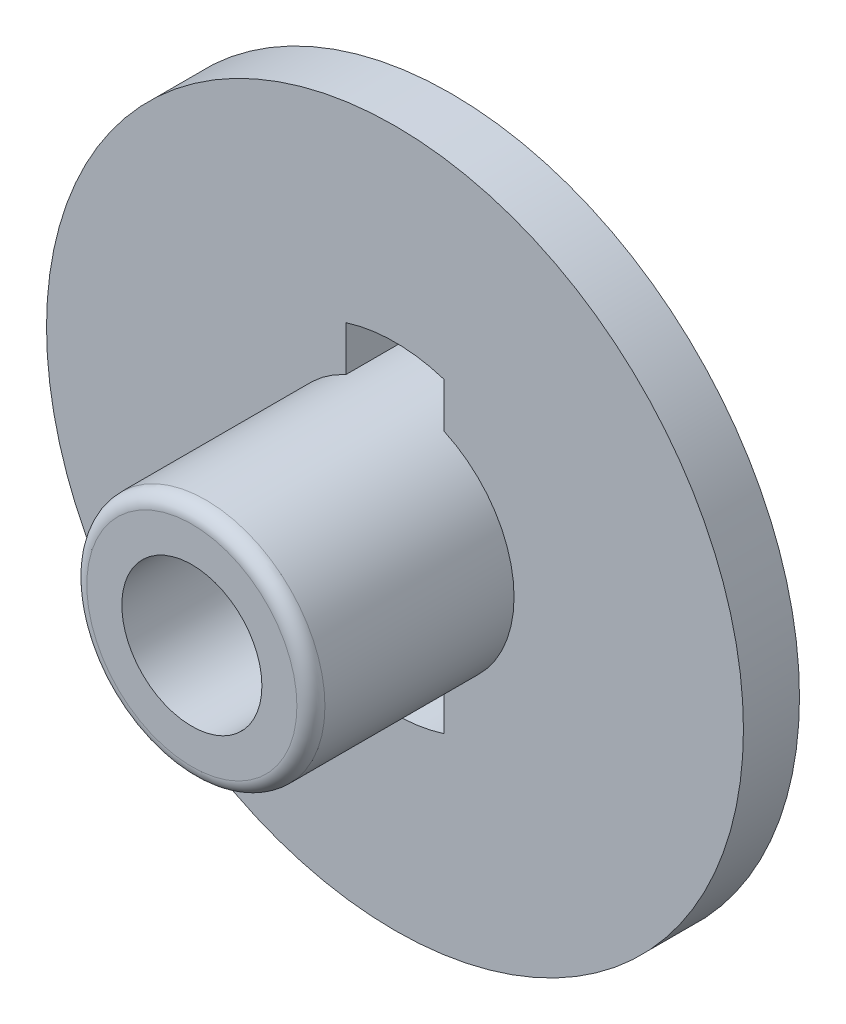
ISO-10303-21;
HEADER;
FILE_DESCRIPTION(('STEP AP214'),'2;1');
FILE_NAME('part.step','',(''),(''),'','','');
FILE_SCHEMA(('AUTOMOTIVE_DESIGN { 1 0 10303 214 1 1 1 1 }'));
ENDSEC;
DATA;
#1=APPLICATION_CONTEXT('core data for automotive mechanical design processes');
#2=APPLICATION_PROTOCOL_DEFINITION('international standard','automotive_design',2000,#1);
#3=PRODUCT_CONTEXT('',#1,'mechanical');
#4=PRODUCT('Part','Part','',(#3));
#5=PRODUCT_RELATED_PRODUCT_CATEGORY('part','',(#4));
#6=PRODUCT_DEFINITION_FORMATION('','',#4);
#7=PRODUCT_DEFINITION_CONTEXT('part definition',#1,'design');
#8=PRODUCT_DEFINITION('design','',#6,#7);
#9=PRODUCT_DEFINITION_SHAPE('','',#8);
#10=(LENGTH_UNIT() NAMED_UNIT(*) SI_UNIT(.MILLI.,.METRE.));
#11=(NAMED_UNIT(*) PLANE_ANGLE_UNIT() SI_UNIT($,.RADIAN.));
#12=(NAMED_UNIT(*) SI_UNIT($,.STERADIAN.) SOLID_ANGLE_UNIT());
#13=UNCERTAINTY_MEASURE_WITH_UNIT(LENGTH_MEASURE(1.E-05),#10,'distance_accuracy_value','');
#14=(GEOMETRIC_REPRESENTATION_CONTEXT(3) GLOBAL_UNCERTAINTY_ASSIGNED_CONTEXT((#13)) GLOBAL_UNIT_ASSIGNED_CONTEXT((#10,
#11,#12)) REPRESENTATION_CONTEXT('',''));
#15=CARTESIAN_POINT('',(0.,0.,0.));
#16=DIRECTION('',(0.,0.,1.));
#17=DIRECTION('',(1.,0.,0.));
#18=AXIS2_PLACEMENT_3D('',#15,#16,#17);
#19=CARTESIAN_POINT('',(0.,0.,0.));
#20=DIRECTION('',(0.,0.,1.));
#21=DIRECTION('',(1.,0.,0.));
#22=AXIS2_PLACEMENT_3D('',#19,#20,#21);
#23=PLANE('',#22);
#24=DIRECTION('',(0.,1.,0.));
#25=VECTOR('',#24,1.);
#26=CARTESIAN_POINT('',(0.7,0.,0.));
#27=LINE('',#26,#25);
#28=CARTESIAN_POINT('',(0.7,1.54919333848297,0.));
#29=VERTEX_POINT('',#28);
#30=CARTESIAN_POINT('',(0.7,2.19089023002066,0.));
#31=VERTEX_POINT('',#30);
#32=EDGE_CURVE('E133',#29,#31,#27,.T.);
#33=ORIENTED_EDGE('',*,*,#32,.T.);
#34=CARTESIAN_POINT('',(0.,0.,0.));
#35=DIRECTION('',(0.,0.,1.));
#36=DIRECTION('',(1.,0.,0.));
#37=AXIS2_PLACEMENT_3D('',#34,#35,#36);
#38=CIRCLE('',#37,2.3);
#39=CARTESIAN_POINT('',(-0.7,2.19089023002066,0.));
#40=VERTEX_POINT('',#39);
#41=EDGE_CURVE('E136',#31,#40,#38,.T.);
#42=ORIENTED_EDGE('',*,*,#41,.T.);
#43=DIRECTION('',(0.,1.,0.));
#44=VECTOR('',#43,1.);
#45=CARTESIAN_POINT('',(-0.7,0.,0.));
#46=LINE('',#45,#44);
#47=CARTESIAN_POINT('',(-0.7,1.54919333848297,0.));
#48=VERTEX_POINT('',#47);
#49=EDGE_CURVE('E139',#48,#40,#46,.T.);
#50=ORIENTED_EDGE('',*,*,#49,.F.);
#51=CARTESIAN_POINT('',(0.,0.,0.));
#52=DIRECTION('',(0.,0.,1.));
#53=DIRECTION('',(1.,0.,0.));
#54=AXIS2_PLACEMENT_3D('',#51,#52,#53);
#55=CIRCLE('',#54,1.7);
#56=EDGE_CURVE('E142',#29,#48,#55,.T.);
#57=ORIENTED_EDGE('',*,*,#56,.F.);
#58=EDGE_LOOP('',(#33,#42,#50,#57));
#59=FACE_BOUND('',#58,.T.);
#60=CARTESIAN_POINT('',(0.,0.,0.));
#61=DIRECTION('',(0.,0.,1.));
#62=DIRECTION('',(1.,0.,0.));
#63=AXIS2_PLACEMENT_3D('',#60,#61,#62);
#64=CIRCLE('',#63,1.15);
#65=CARTESIAN_POINT('',(1.15,0.,0.));
#66=VERTEX_POINT('',#65);
#67=EDGE_CURVE('E163',#66,#66,#64,.T.);
#68=ORIENTED_EDGE('',*,*,#67,.T.);
#69=EDGE_LOOP('',(#68));
#70=FACE_BOUND('',#69,.T.);
#71=CARTESIAN_POINT('',(0.,0.,0.));
#72=DIRECTION('',(0.,0.,1.));
#73=DIRECTION('',(1.,0.,0.));
#74=AXIS2_PLACEMENT_3D('',#71,#72,#73);
#75=CIRCLE('',#74,4.975);
#76=CARTESIAN_POINT('',(4.975,0.,0.));
#77=VERTEX_POINT('',#76);
#78=EDGE_CURVE('E172',#77,#77,#75,.T.);
#79=ORIENTED_EDGE('',*,*,#78,.F.);
#80=EDGE_LOOP('',(#79));
#81=FACE_BOUND('',#80,.T.);
#82=CARTESIAN_POINT('',(0.,0.,0.));
#83=DIRECTION('',(0.,0.,1.));
#84=DIRECTION('',(1.,0.,0.));
#85=AXIS2_PLACEMENT_3D('',#82,#83,#84);
#86=CIRCLE('',#85,1.7);
#87=CARTESIAN_POINT('',(-0.7,-1.54919333848297,0.));
#88=VERTEX_POINT('',#87);
#89=CARTESIAN_POINT('',(0.7,-1.54919333848297,0.));
#90=VERTEX_POINT('',#89);
#91=EDGE_CURVE('E110',#88,#90,#86,.T.);
#92=ORIENTED_EDGE('',*,*,#91,.F.);
#93=DIRECTION('',(0.,1.,0.));
#94=VECTOR('',#93,1.);
#95=CARTESIAN_POINT('',(-0.7,0.,0.));
#96=LINE('',#95,#94);
#97=CARTESIAN_POINT('',(-0.7,-2.19089023002066,0.));
#98=VERTEX_POINT('',#97);
#99=EDGE_CURVE('E48',#98,#88,#96,.T.);
#100=ORIENTED_EDGE('',*,*,#99,.F.);
#101=CARTESIAN_POINT('',(0.,0.,0.));
#102=DIRECTION('',(0.,0.,1.));
#103=DIRECTION('',(1.,0.,0.));
#104=AXIS2_PLACEMENT_3D('',#101,#102,#103);
#105=CIRCLE('',#104,2.3);
#106=CARTESIAN_POINT('',(0.7,-2.19089023002066,0.));
#107=VERTEX_POINT('',#106);
#108=EDGE_CURVE('E116',#98,#107,#105,.T.);
#109=ORIENTED_EDGE('',*,*,#108,.T.);
#110=DIRECTION('',(0.,1.,0.));
#111=VECTOR('',#110,1.);
#112=CARTESIAN_POINT('',(0.7,0.,0.));
#113=LINE('',#112,#111);
#114=EDGE_CURVE('E101',#107,#90,#113,.T.);
#115=ORIENTED_EDGE('',*,*,#114,.T.);
#116=EDGE_LOOP('',(#92,#100,#109,#115));
#117=FACE_BOUND('',#116,.T.);
#118=ADVANCED_FACE('F33',(#59,#70,#81,#117),#23,.F.);
#119=CARTESIAN_POINT('',(0.,0.,0.8));
#120=DIRECTION('',(0.,0.,1.));
#121=DIRECTION('',(1.,0.,0.));
#122=AXIS2_PLACEMENT_3D('',#119,#120,#121);
#123=PLANE('',#122);
#124=DIRECTION('',(0.,-1.,0.));
#125=VECTOR('',#124,1.);
#126=CARTESIAN_POINT('',(-0.7,0.,0.8));
#127=LINE('',#126,#125);
#128=CARTESIAN_POINT('',(-0.7,-1.54919333848297,0.8));
#129=VERTEX_POINT('',#128);
#130=CARTESIAN_POINT('',(-0.7,-2.19089023002066,0.8));
#131=VERTEX_POINT('',#130);
#132=EDGE_CURVE('E128',#129,#131,#127,.T.);
#133=ORIENTED_EDGE('',*,*,#132,.F.);
#134=CARTESIAN_POINT('',(0.,0.,0.8));
#135=DIRECTION('',(0.,0.,1.));
#136=DIRECTION('',(1.,0.,0.));
#137=AXIS2_PLACEMENT_3D('',#134,#135,#136);
#138=CIRCLE('',#137,1.7);
#139=CARTESIAN_POINT('',(-0.7,1.54919333848297,0.8));
#140=VERTEX_POINT('',#139);
#141=EDGE_CURVE('E167',#129,#140,#138,.F.);
#142=ORIENTED_EDGE('',*,*,#141,.T.);
#143=DIRECTION('',(0.,-1.,0.));
#144=VECTOR('',#143,1.);
#145=CARTESIAN_POINT('',(-0.7,0.,0.8));
#146=LINE('',#145,#144);
#147=CARTESIAN_POINT('',(-0.7,2.19089023002066,0.8));
#148=VERTEX_POINT('',#147);
#149=EDGE_CURVE('E154',#148,#140,#146,.T.);
#150=ORIENTED_EDGE('',*,*,#149,.F.);
#151=CARTESIAN_POINT('',(0.,0.,0.8));
#152=DIRECTION('',(0.,0.,1.));
#153=DIRECTION('',(1.,0.,0.));
#154=AXIS2_PLACEMENT_3D('',#151,#152,#153);
#155=CIRCLE('',#154,2.3);
#156=CARTESIAN_POINT('',(0.7,2.19089023002066,0.8));
#157=VERTEX_POINT('',#156);
#158=EDGE_CURVE('E160',#148,#157,#155,.F.);
#159=ORIENTED_EDGE('',*,*,#158,.T.);
#160=DIRECTION('',(0.,-1.,0.));
#161=VECTOR('',#160,1.);
#162=CARTESIAN_POINT('',(0.7,0.,0.8));
#163=LINE('',#162,#161);
#164=CARTESIAN_POINT('',(0.7,1.54919333848297,0.8));
#165=VERTEX_POINT('',#164);
#166=EDGE_CURVE('E157',#157,#165,#163,.T.);
#167=ORIENTED_EDGE('',*,*,#166,.T.);
#168=CARTESIAN_POINT('',(0.7,-1.54919333848297,0.8));
#169=VERTEX_POINT('',#168);
#170=EDGE_CURVE('E170',#165,#169,#138,.F.);
#171=ORIENTED_EDGE('',*,*,#170,.T.);
#172=DIRECTION('',(0.,-1.,0.));
#173=VECTOR('',#172,1.);
#174=CARTESIAN_POINT('',(0.7,0.,0.8));
#175=LINE('',#174,#173);
#176=CARTESIAN_POINT('',(0.7,-2.19089023002066,0.8));
#177=VERTEX_POINT('',#176);
#178=EDGE_CURVE('E104',#169,#177,#175,.T.);
#179=ORIENTED_EDGE('',*,*,#178,.T.);
#180=CARTESIAN_POINT('',(0.,0.,0.8));
#181=DIRECTION('',(0.,0.,1.));
#182=DIRECTION('',(1.,0.,0.));
#183=AXIS2_PLACEMENT_3D('',#180,#181,#182);
#184=CIRCLE('',#183,2.3);
#185=EDGE_CURVE('E130',#177,#131,#184,.F.);
#186=ORIENTED_EDGE('',*,*,#185,.T.);
#187=EDGE_LOOP('',(#133,#142,#150,#159,#167,#171,#179,#186));
#188=FACE_BOUND('',#187,.T.);
#189=CARTESIAN_POINT('',(0.,0.,0.8));
#190=DIRECTION('',(0.,0.,1.));
#191=DIRECTION('',(1.,0.,0.));
#192=AXIS2_PLACEMENT_3D('',#189,#190,#191);
#193=CIRCLE('',#192,4.975);
#194=CARTESIAN_POINT('',(4.975,0.,0.8));
#195=VERTEX_POINT('',#194);
#196=EDGE_CURVE('E173',#195,#195,#193,.T.);
#197=ORIENTED_EDGE('',*,*,#196,.T.);
#198=EDGE_LOOP('',(#197));
#199=FACE_BOUND('',#198,.T.);
#200=ADVANCED_FACE('F194',(#188,#199),#123,.T.);
#201=CARTESIAN_POINT('',(0.,0.,0.8));
#202=DIRECTION('',(0.,0.,-1.));
#203=DIRECTION('',(-1.,0.,0.));
#204=AXIS2_PLACEMENT_3D('',#201,#202,#203);
#205=CYLINDRICAL_SURFACE('',#204,4.975);
#206=ORIENTED_EDGE('',*,*,#196,.F.);
#207=EDGE_LOOP('',(#206));
#208=FACE_BOUND('',#207,.T.);
#209=ORIENTED_EDGE('',*,*,#78,.T.);
#210=EDGE_LOOP('',(#209));
#211=FACE_BOUND('',#210,.T.);
#212=ADVANCED_FACE('F200',(#208,#211),#205,.T.);
#213=CARTESIAN_POINT('',(0.,0.,3.7));
#214=DIRECTION('',(0.,0.,-1.));
#215=DIRECTION('',(-1.,0.,0.));
#216=AXIS2_PLACEMENT_3D('',#213,#214,#215);
#217=CYLINDRICAL_SURFACE('',#216,1.7);
#218=CARTESIAN_POINT('',(0.,0.,3.5));
#219=DIRECTION('',(0.,0.,1.));
#220=DIRECTION('',(1.,0.,0.));
#221=AXIS2_PLACEMENT_3D('',#218,#219,#220);
#222=CIRCLE('',#221,1.7);
#223=CARTESIAN_POINT('',(1.7,0.,3.5));
#224=VERTEX_POINT('',#223);
#225=EDGE_CURVE('E11',#224,#224,#222,.F.);
#226=ORIENTED_EDGE('',*,*,#225,.T.);
#227=EDGE_LOOP('',(#226));
#228=FACE_BOUND('',#227,.T.);
#229=ORIENTED_EDGE('',*,*,#141,.F.);
#230=DIRECTION('',(0.,0.,-1.));
#231=VECTOR('',#230,1.);
#232=CARTESIAN_POINT('',(-0.7,-1.54919333848297,3.7));
#233=LINE('',#232,#231);
#234=EDGE_CURVE('E106',#129,#88,#233,.T.);
#235=ORIENTED_EDGE('',*,*,#234,.T.);
#236=ORIENTED_EDGE('',*,*,#91,.T.);
#237=DIRECTION('',(0.,0.,-1.));
#238=VECTOR('',#237,1.);
#239=CARTESIAN_POINT('',(0.7,-1.54919333848297,3.7));
#240=LINE('',#239,#238);
#241=EDGE_CURVE('E56',#169,#90,#240,.T.);
#242=ORIENTED_EDGE('',*,*,#241,.F.);
#243=ORIENTED_EDGE('',*,*,#170,.F.);
#244=DIRECTION('',(0.,0.,-1.));
#245=VECTOR('',#244,1.);
#246=CARTESIAN_POINT('',(0.7,1.54919333848297,3.7));
#247=LINE('',#246,#245);
#248=EDGE_CURVE('E145',#165,#29,#247,.T.);
#249=ORIENTED_EDGE('',*,*,#248,.T.);
#250=ORIENTED_EDGE('',*,*,#56,.T.);
#251=DIRECTION('',(0.,0.,-1.));
#252=VECTOR('',#251,1.);
#253=CARTESIAN_POINT('',(-0.7,1.54919333848297,3.7));
#254=LINE('',#253,#252);
#255=EDGE_CURVE('E148',#140,#48,#254,.T.);
#256=ORIENTED_EDGE('',*,*,#255,.F.);
#257=EDGE_LOOP('',(#229,#235,#236,#242,#243,#249,#250,#256));
#258=FACE_BOUND('',#257,.T.);
#259=ADVANCED_FACE('F112',(#228,#258),#217,.T.);
#260=CARTESIAN_POINT('',(0.,0.,3.7));
#261=DIRECTION('',(0.,0.,1.));
#262=DIRECTION('',(1.,0.,0.));
#263=AXIS2_PLACEMENT_3D('',#260,#261,#262);
#264=PLANE('',#263);
#265=CARTESIAN_POINT('',(0.,0.,3.7));
#266=DIRECTION('',(0.,0.,1.));
#267=DIRECTION('',(1.,0.,0.));
#268=AXIS2_PLACEMENT_3D('',#265,#266,#267);
#269=CIRCLE('',#268,1.5);
#270=CARTESIAN_POINT('',(1.5,0.,3.7));
#271=VERTEX_POINT('',#270);
#272=EDGE_CURVE('E41',#271,#271,#269,.T.);
#273=ORIENTED_EDGE('',*,*,#272,.T.);
#274=EDGE_LOOP('',(#273));
#275=FACE_BOUND('',#274,.T.);
#276=CARTESIAN_POINT('',(0.,0.,3.7));
#277=DIRECTION('',(0.,0.,1.));
#278=DIRECTION('',(1.,0.,0.));
#279=AXIS2_PLACEMENT_3D('',#276,#277,#278);
#280=CIRCLE('',#279,1.);
#281=CARTESIAN_POINT('',(1.,0.,3.7));
#282=VERTEX_POINT('',#281);
#283=EDGE_CURVE('E123',#282,#282,#280,.T.);
#284=ORIENTED_EDGE('',*,*,#283,.F.);
#285=EDGE_LOOP('',(#284));
#286=FACE_BOUND('',#285,.T.);
#287=ADVANCED_FACE('F182',(#275,#286),#264,.T.);
#288=CARTESIAN_POINT('',(0.,0.,0.5));
#289=DIRECTION('',(0.,0.,-1.));
#290=DIRECTION('',(-1.,0.,0.));
#291=AXIS2_PLACEMENT_3D('',#288,#289,#290);
#292=CYLINDRICAL_SURFACE('',#291,1.15);
#293=CARTESIAN_POINT('',(0.,0.,0.5));
#294=DIRECTION('',(0.,0.,1.));
#295=DIRECTION('',(1.,0.,0.));
#296=AXIS2_PLACEMENT_3D('',#293,#294,#295);
#297=CIRCLE('',#296,1.15);
#298=CARTESIAN_POINT('',(1.15,0.,0.5));
#299=VERTEX_POINT('',#298);
#300=EDGE_CURVE('E164',#299,#299,#297,.T.);
#301=ORIENTED_EDGE('',*,*,#300,.T.);
#302=EDGE_LOOP('',(#301));
#303=FACE_BOUND('',#302,.T.);
#304=ORIENTED_EDGE('',*,*,#67,.F.);
#305=EDGE_LOOP('',(#304));
#306=FACE_BOUND('',#305,.T.);
#307=ADVANCED_FACE('F219',(#303,#306),#292,.F.);
#308=CARTESIAN_POINT('',(0.,0.,0.5));
#309=DIRECTION('',(0.,0.,1.));
#310=DIRECTION('',(1.,0.,0.));
#311=AXIS2_PLACEMENT_3D('',#308,#309,#310);
#312=PLANE('',#311);
#313=CARTESIAN_POINT('',(0.,0.,0.5));
#314=DIRECTION('',(0.,0.,1.));
#315=DIRECTION('',(1.,0.,0.));
#316=AXIS2_PLACEMENT_3D('',#313,#314,#315);
#317=CIRCLE('',#316,1.);
#318=CARTESIAN_POINT('',(1.,0.,0.5));
#319=VERTEX_POINT('',#318);
#320=EDGE_CURVE('E122',#319,#319,#317,.F.);
#321=ORIENTED_EDGE('',*,*,#320,.F.);
#322=EDGE_LOOP('',(#321));
#323=FACE_BOUND('',#322,.T.);
#324=ORIENTED_EDGE('',*,*,#300,.F.);
#325=EDGE_LOOP('',(#324));
#326=FACE_BOUND('',#325,.T.);
#327=ADVANCED_FACE('F224',(#323,#326),#312,.F.);
#328=CARTESIAN_POINT('',(0.7,0.,3.7));
#329=DIRECTION('',(-1.,0.,0.));
#330=DIRECTION('',(0.,0.,1.));
#331=AXIS2_PLACEMENT_3D('',#328,#329,#330);
#332=PLANE('',#331);
#333=DIRECTION('',(0.,0.,-1.));
#334=VECTOR('',#333,1.);
#335=CARTESIAN_POINT('',(0.7,2.19089023002066,3.7));
#336=LINE('',#335,#334);
#337=EDGE_CURVE('E152',#157,#31,#336,.T.);
#338=ORIENTED_EDGE('',*,*,#337,.T.);
#339=ORIENTED_EDGE('',*,*,#32,.F.);
#340=ORIENTED_EDGE('',*,*,#248,.F.);
#341=ORIENTED_EDGE('',*,*,#166,.F.);
#342=EDGE_LOOP('',(#338,#339,#340,#341));
#343=FACE_BOUND('',#342,.T.);
#344=ADVANCED_FACE('F228',(#343),#332,.T.);
#345=CARTESIAN_POINT('',(0.,0.,3.7));
#346=DIRECTION('',(0.,0.,-1.));
#347=DIRECTION('',(-1.,0.,0.));
#348=AXIS2_PLACEMENT_3D('',#345,#346,#347);
#349=CYLINDRICAL_SURFACE('',#348,2.3);
#350=DIRECTION('',(0.,0.,-1.));
#351=VECTOR('',#350,1.);
#352=CARTESIAN_POINT('',(-0.7,2.19089023002066,3.7));
#353=LINE('',#352,#351);
#354=EDGE_CURVE('E150',#148,#40,#353,.T.);
#355=ORIENTED_EDGE('',*,*,#354,.T.);
#356=ORIENTED_EDGE('',*,*,#41,.F.);
#357=ORIENTED_EDGE('',*,*,#337,.F.);
#358=ORIENTED_EDGE('',*,*,#158,.F.);
#359=EDGE_LOOP('',(#355,#356,#357,#358));
#360=FACE_BOUND('',#359,.T.);
#361=ADVANCED_FACE('F232',(#360),#349,.F.);
#362=CARTESIAN_POINT('',(-0.7,0.,3.7));
#363=DIRECTION('',(-1.,0.,0.));
#364=DIRECTION('',(0.,0.,1.));
#365=AXIS2_PLACEMENT_3D('',#362,#363,#364);
#366=PLANE('',#365);
#367=ORIENTED_EDGE('',*,*,#149,.T.);
#368=ORIENTED_EDGE('',*,*,#255,.T.);
#369=ORIENTED_EDGE('',*,*,#49,.T.);
#370=ORIENTED_EDGE('',*,*,#354,.F.);
#371=EDGE_LOOP('',(#367,#368,#369,#370));
#372=FACE_BOUND('',#371,.T.);
#373=ADVANCED_FACE('F236',(#372),#366,.F.);
#374=CARTESIAN_POINT('',(0.,0.,3.7));
#375=DIRECTION('',(0.,0.,-1.));
#376=DIRECTION('',(-1.,0.,0.));
#377=AXIS2_PLACEMENT_3D('',#374,#375,#376);
#378=CYLINDRICAL_SURFACE('',#377,1.);
#379=ORIENTED_EDGE('',*,*,#283,.T.);
#380=EDGE_LOOP('',(#379));
#381=FACE_BOUND('',#380,.T.);
#382=ORIENTED_EDGE('',*,*,#320,.T.);
#383=EDGE_LOOP('',(#382));
#384=FACE_BOUND('',#383,.T.);
#385=ADVANCED_FACE('F240',(#381,#384),#378,.F.);
#386=CARTESIAN_POINT('',(-0.7,0.,3.7));
#387=DIRECTION('',(-1.,0.,0.));
#388=DIRECTION('',(0.,0.,1.));
#389=AXIS2_PLACEMENT_3D('',#386,#387,#388);
#390=PLANE('',#389);
#391=ORIENTED_EDGE('',*,*,#132,.T.);
#392=DIRECTION('',(0.,0.,-1.));
#393=VECTOR('',#392,1.);
#394=CARTESIAN_POINT('',(-0.7,-2.19089023002066,3.7));
#395=LINE('',#394,#393);
#396=EDGE_CURVE('E126',#131,#98,#395,.T.);
#397=ORIENTED_EDGE('',*,*,#396,.T.);
#398=ORIENTED_EDGE('',*,*,#99,.T.);
#399=ORIENTED_EDGE('',*,*,#234,.F.);
#400=EDGE_LOOP('',(#391,#397,#398,#399));
#401=FACE_BOUND('',#400,.T.);
#402=ADVANCED_FACE('F243',(#401),#390,.F.);
#403=CARTESIAN_POINT('',(0.,0.,3.7));
#404=DIRECTION('',(0.,0.,-1.));
#405=DIRECTION('',(-1.,0.,0.));
#406=AXIS2_PLACEMENT_3D('',#403,#404,#405);
#407=CYLINDRICAL_SURFACE('',#406,2.3);
#408=DIRECTION('',(0.,0.,-1.));
#409=VECTOR('',#408,1.);
#410=CARTESIAN_POINT('',(0.7,-2.19089023002066,3.7));
#411=LINE('',#410,#409);
#412=EDGE_CURVE('E107',#177,#107,#411,.T.);
#413=ORIENTED_EDGE('',*,*,#412,.T.);
#414=ORIENTED_EDGE('',*,*,#108,.F.);
#415=ORIENTED_EDGE('',*,*,#396,.F.);
#416=ORIENTED_EDGE('',*,*,#185,.F.);
#417=EDGE_LOOP('',(#413,#414,#415,#416));
#418=FACE_BOUND('',#417,.T.);
#419=ADVANCED_FACE('F190',(#418),#407,.F.);
#420=CARTESIAN_POINT('',(0.7,0.,3.7));
#421=DIRECTION('',(-1.,0.,0.));
#422=DIRECTION('',(0.,0.,1.));
#423=AXIS2_PLACEMENT_3D('',#420,#421,#422);
#424=PLANE('',#423);
#425=ORIENTED_EDGE('',*,*,#241,.T.);
#426=ORIENTED_EDGE('',*,*,#114,.F.);
#427=ORIENTED_EDGE('',*,*,#412,.F.);
#428=ORIENTED_EDGE('',*,*,#178,.F.);
#429=EDGE_LOOP('',(#425,#426,#427,#428));
#430=FACE_BOUND('',#429,.T.);
#431=ADVANCED_FACE('F98',(#430),#424,.T.);
#432=CARTESIAN_POINT('',(0.,0.,3.5));
#433=DIRECTION('',(0.,0.,1.));
#434=DIRECTION('',(1.,0.,0.));
#435=AXIS2_PLACEMENT_3D('',#432,#433,#434);
#436=TOROIDAL_SURFACE('',#435,1.5,0.2);
#437=ORIENTED_EDGE('',*,*,#225,.F.);
#438=EDGE_LOOP('',(#437));
#439=FACE_BOUND('',#438,.T.);
#440=ORIENTED_EDGE('',*,*,#272,.F.);
#441=EDGE_LOOP('',(#440));
#442=FACE_BOUND('',#441,.T.);
#443=ADVANCED_FACE('F35',(#439,#442),#436,.T.);
#444=CLOSED_SHELL('',(#118,#200,#212,#259,#287,#307,#327,#344,#361,#373,#385,#402,#419,#431,#443));
#445=MANIFOLD_SOLID_BREP('B2',#444);
#446=ADVANCED_BREP_SHAPE_REPRESENTATION('',(#18,#445),#14);
#447=SHAPE_DEFINITION_REPRESENTATION(#9,#446);
ENDSEC;
END-ISO-10303-21;
